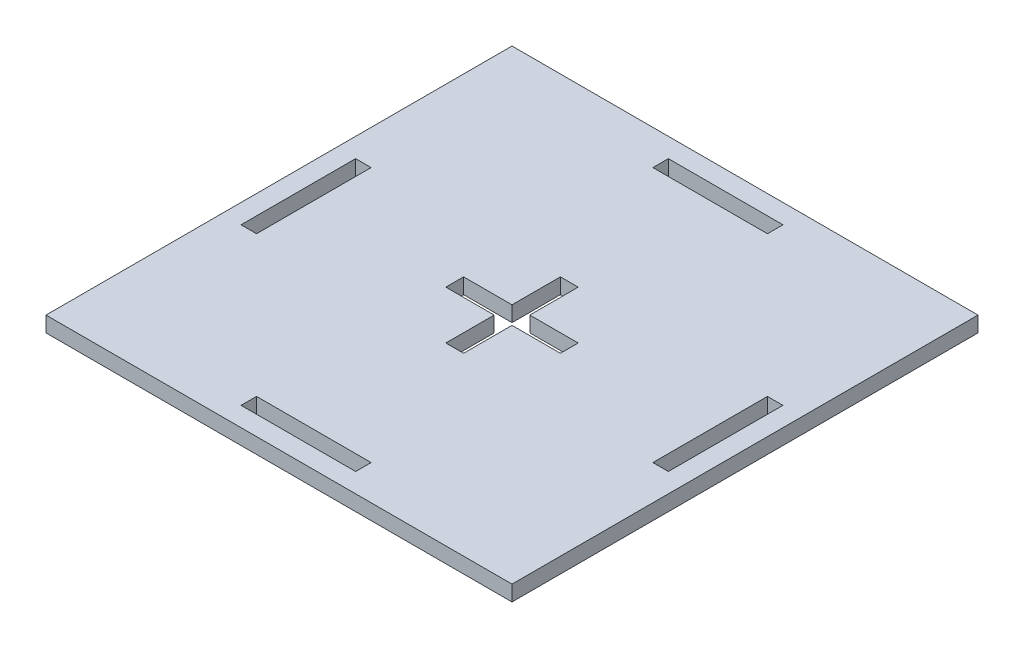
ISO-10303-21;
HEADER;
FILE_DESCRIPTION(('STEP AP214'),'2;1');
FILE_NAME('part.step','',(''),(''),'','','');
FILE_SCHEMA(('AUTOMOTIVE_DESIGN { 1 0 10303 214 1 1 1 1 }'));
ENDSEC;
DATA;
#1=APPLICATION_CONTEXT('core data for automotive mechanical design processes');
#2=APPLICATION_PROTOCOL_DEFINITION('international standard','automotive_design',2000,#1);
#3=PRODUCT_CONTEXT('',#1,'mechanical');
#4=PRODUCT('Part','Part','',(#3));
#5=PRODUCT_RELATED_PRODUCT_CATEGORY('part','',(#4));
#6=PRODUCT_DEFINITION_FORMATION('','',#4);
#7=PRODUCT_DEFINITION_CONTEXT('part definition',#1,'design');
#8=PRODUCT_DEFINITION('design','',#6,#7);
#9=PRODUCT_DEFINITION_SHAPE('','',#8);
#10=(LENGTH_UNIT() NAMED_UNIT(*) SI_UNIT(.MILLI.,.METRE.));
#11=(NAMED_UNIT(*) PLANE_ANGLE_UNIT() SI_UNIT($,.RADIAN.));
#12=(NAMED_UNIT(*) SI_UNIT($,.STERADIAN.) SOLID_ANGLE_UNIT());
#13=UNCERTAINTY_MEASURE_WITH_UNIT(LENGTH_MEASURE(1.E-05),#10,'distance_accuracy_value','');
#14=(GEOMETRIC_REPRESENTATION_CONTEXT(3) GLOBAL_UNCERTAINTY_ASSIGNED_CONTEXT((#13)) GLOBAL_UNIT_ASSIGNED_CONTEXT((#10,
#11,#12)) REPRESENTATION_CONTEXT('',''));
#15=CARTESIAN_POINT('',(0.,0.,0.));
#16=DIRECTION('',(0.,0.,1.));
#17=DIRECTION('',(1.,0.,0.));
#18=AXIS2_PLACEMENT_3D('',#15,#16,#17);
#19=CARTESIAN_POINT('',(0.,-2.,0.));
#20=DIRECTION('',(0.,1.,0.));
#21=DIRECTION('',(0.,0.,1.));
#22=AXIS2_PLACEMENT_3D('',#19,#20,#21);
#23=PLANE('',#22);
#24=DIRECTION('',(1.,0.,0.));
#25=VECTOR('',#24,1.);
#26=CARTESIAN_POINT('',(0.,-2.,28.95));
#27=LINE('',#26,#25);
#28=CARTESIAN_POINT('',(31.25,-2.,28.95));
#29=VERTEX_POINT('',#28);
#30=CARTESIAN_POINT('',(37.5,-2.,28.95));
#31=VERTEX_POINT('',#30);
#32=EDGE_CURVE('E494',#29,#31,#27,.T.);
#33=ORIENTED_EDGE('',*,*,#32,.F.);
#34=DIRECTION('',(0.,0.,1.));
#35=VECTOR('',#34,1.);
#36=CARTESIAN_POINT('',(31.25,-2.,0.));
#37=LINE('',#36,#35);
#38=CARTESIAN_POINT('',(31.25,-2.,22.7));
#39=VERTEX_POINT('',#38);
#40=EDGE_CURVE('E466',#39,#29,#37,.T.);
#41=ORIENTED_EDGE('',*,*,#40,.F.);
#42=DIRECTION('',(1.,0.,0.));
#43=VECTOR('',#42,1.);
#44=CARTESIAN_POINT('',(0.,-2.,22.7));
#45=LINE('',#44,#43);
#46=CARTESIAN_POINT('',(28.95,-2.,22.7));
#47=VERTEX_POINT('',#46);
#48=EDGE_CURVE('E468',#47,#39,#45,.T.);
#49=ORIENTED_EDGE('',*,*,#48,.F.);
#50=DIRECTION('',(0.,0.,1.));
#51=VECTOR('',#50,1.);
#52=CARTESIAN_POINT('',(28.95,-2.,0.));
#53=LINE('',#52,#51);
#54=CARTESIAN_POINT('',(28.95,-2.,28.95));
#55=VERTEX_POINT('',#54);
#56=EDGE_CURVE('E470',#47,#55,#53,.T.);
#57=ORIENTED_EDGE('',*,*,#56,.T.);
#58=DIRECTION('',(1.,0.,0.));
#59=VECTOR('',#58,1.);
#60=CARTESIAN_POINT('',(0.,-2.,28.95));
#61=LINE('',#60,#59);
#62=CARTESIAN_POINT('',(22.7,-2.,28.95));
#63=VERTEX_POINT('',#62);
#64=EDGE_CURVE('E473',#63,#55,#61,.T.);
#65=ORIENTED_EDGE('',*,*,#64,.F.);
#66=DIRECTION('',(0.,0.,1.));
#67=VECTOR('',#66,1.);
#68=CARTESIAN_POINT('',(22.7,-2.,0.));
#69=LINE('',#68,#67);
#70=CARTESIAN_POINT('',(22.7,-2.,31.25));
#71=VERTEX_POINT('',#70);
#72=EDGE_CURVE('E475',#63,#71,#69,.T.);
#73=ORIENTED_EDGE('',*,*,#72,.T.);
#74=DIRECTION('',(1.,0.,0.));
#75=VECTOR('',#74,1.);
#76=CARTESIAN_POINT('',(0.,-2.,31.25));
#77=LINE('',#76,#75);
#78=CARTESIAN_POINT('',(28.95,-2.,31.25));
#79=VERTEX_POINT('',#78);
#80=EDGE_CURVE('E478',#71,#79,#77,.T.);
#81=ORIENTED_EDGE('',*,*,#80,.T.);
#82=DIRECTION('',(0.,0.,1.));
#83=VECTOR('',#82,1.);
#84=CARTESIAN_POINT('',(28.95,-2.,0.));
#85=LINE('',#84,#83);
#86=CARTESIAN_POINT('',(28.95,-2.,37.5));
#87=VERTEX_POINT('',#86);
#88=EDGE_CURVE('E481',#79,#87,#85,.T.);
#89=ORIENTED_EDGE('',*,*,#88,.T.);
#90=DIRECTION('',(1.,0.,0.));
#91=VECTOR('',#90,1.);
#92=CARTESIAN_POINT('',(0.,-2.,37.5));
#93=LINE('',#92,#91);
#94=CARTESIAN_POINT('',(31.25,-2.,37.5));
#95=VERTEX_POINT('',#94);
#96=EDGE_CURVE('E484',#87,#95,#93,.T.);
#97=ORIENTED_EDGE('',*,*,#96,.T.);
#98=DIRECTION('',(0.,0.,1.));
#99=VECTOR('',#98,1.);
#100=CARTESIAN_POINT('',(31.25,-2.,0.));
#101=LINE('',#100,#99);
#102=CARTESIAN_POINT('',(31.25,-2.,31.25));
#103=VERTEX_POINT('',#102);
#104=EDGE_CURVE('E487',#103,#95,#101,.T.);
#105=ORIENTED_EDGE('',*,*,#104,.F.);
#106=DIRECTION('',(1.,0.,0.));
#107=VECTOR('',#106,1.);
#108=CARTESIAN_POINT('',(0.,-2.,31.25));
#109=LINE('',#108,#107);
#110=CARTESIAN_POINT('',(37.5,-2.,31.25));
#111=VERTEX_POINT('',#110);
#112=EDGE_CURVE('E489',#103,#111,#109,.T.);
#113=ORIENTED_EDGE('',*,*,#112,.T.);
#114=DIRECTION('',(0.,0.,1.));
#115=VECTOR('',#114,1.);
#116=CARTESIAN_POINT('',(37.5,-2.,0.));
#117=LINE('',#116,#115);
#118=EDGE_CURVE('E492',#31,#111,#117,.T.);
#119=ORIENTED_EDGE('',*,*,#118,.F.);
#120=EDGE_LOOP('',(#33,#41,#49,#57,#65,#73,#81,#89,#97,#105,#113,#119));
#121=FACE_BOUND('',#120,.T.);
#122=DIRECTION('',(0.,0.,1.));
#123=VECTOR('',#122,1.);
#124=CARTESIAN_POINT('',(0.,-2.,0.));
#125=LINE('',#124,#123);
#126=CARTESIAN_POINT('',(0.,-2.,0.));
#127=VERTEX_POINT('',#126);
#128=CARTESIAN_POINT('',(0.,-2.,60.2));
#129=VERTEX_POINT('',#128);
#130=EDGE_CURVE('E506',#127,#129,#125,.T.);
#131=ORIENTED_EDGE('',*,*,#130,.F.);
#132=DIRECTION('',(1.,0.,0.));
#133=VECTOR('',#132,1.);
#134=CARTESIAN_POINT('',(0.,-2.,0.));
#135=LINE('',#134,#133);
#136=CARTESIAN_POINT('',(60.2,-2.,0.));
#137=VERTEX_POINT('',#136);
#138=EDGE_CURVE('E515',#127,#137,#135,.T.);
#139=ORIENTED_EDGE('',*,*,#138,.T.);
#140=DIRECTION('',(0.,0.,1.));
#141=VECTOR('',#140,1.);
#142=CARTESIAN_POINT('',(60.2,-2.,0.));
#143=LINE('',#142,#141);
#144=CARTESIAN_POINT('',(60.2,-2.,60.2));
#145=VERTEX_POINT('',#144);
#146=EDGE_CURVE('E513',#137,#145,#143,.T.);
#147=ORIENTED_EDGE('',*,*,#146,.T.);
#148=DIRECTION('',(1.,0.,0.));
#149=VECTOR('',#148,1.);
#150=CARTESIAN_POINT('',(0.,-2.,60.2));
#151=LINE('',#150,#149);
#152=EDGE_CURVE('E509',#129,#145,#151,.T.);
#153=ORIENTED_EDGE('',*,*,#152,.F.);
#154=EDGE_LOOP('',(#131,#139,#147,#153));
#155=FACE_BOUND('',#154,.T.);
#156=DIRECTION('',(0.,0.,1.));
#157=VECTOR('',#156,1.);
#158=CARTESIAN_POINT('',(2.5,-2.,0.));
#159=LINE('',#158,#157);
#160=CARTESIAN_POINT('',(2.5,-2.,22.7));
#161=VERTEX_POINT('',#160);
#162=CARTESIAN_POINT('',(2.5,-2.,37.5));
#163=VERTEX_POINT('',#162);
#164=EDGE_CURVE('E441',#161,#163,#159,.T.);
#165=ORIENTED_EDGE('',*,*,#164,.T.);
#166=DIRECTION('',(1.,0.,0.));
#167=VECTOR('',#166,1.);
#168=CARTESIAN_POINT('',(-1.30104260698261E-13,-2.,37.5));
#169=LINE('',#168,#167);
#170=CARTESIAN_POINT('',(4.5,-2.,37.5));
#171=VERTEX_POINT('',#170);
#172=EDGE_CURVE('E444',#163,#171,#169,.T.);
#173=ORIENTED_EDGE('',*,*,#172,.T.);
#174=DIRECTION('',(0.,0.,-1.));
#175=VECTOR('',#174,1.);
#176=CARTESIAN_POINT('',(4.5,-2.,0.));
#177=LINE('',#176,#175);
#178=CARTESIAN_POINT('',(4.5,-2.,22.7));
#179=VERTEX_POINT('',#178);
#180=EDGE_CURVE('E262',#171,#179,#177,.T.);
#181=ORIENTED_EDGE('',*,*,#180,.T.);
#182=DIRECTION('',(1.,0.,0.));
#183=VECTOR('',#182,1.);
#184=CARTESIAN_POINT('',(0.,-2.,22.7));
#185=LINE('',#184,#183);
#186=EDGE_CURVE('E438',#161,#179,#185,.T.);
#187=ORIENTED_EDGE('',*,*,#186,.F.);
#188=EDGE_LOOP('',(#165,#173,#181,#187));
#189=FACE_BOUND('',#188,.T.);
#190=DIRECTION('',(-1.,0.,0.));
#191=VECTOR('',#190,1.);
#192=CARTESIAN_POINT('',(0.,-2.,4.5));
#193=LINE('',#192,#191);
#194=CARTESIAN_POINT('',(37.5,-2.,4.5));
#195=VERTEX_POINT('',#194);
#196=CARTESIAN_POINT('',(22.7,-2.,4.5));
#197=VERTEX_POINT('',#196);
#198=EDGE_CURVE('E452',#195,#197,#193,.T.);
#199=ORIENTED_EDGE('',*,*,#198,.F.);
#200=DIRECTION('',(0.,0.,-1.));
#201=VECTOR('',#200,1.);
#202=CARTESIAN_POINT('',(37.5,-2.,0.));
#203=LINE('',#202,#201);
#204=CARTESIAN_POINT('',(37.5,-2.,2.5));
#205=VERTEX_POINT('',#204);
#206=EDGE_CURVE('E454',#195,#205,#203,.T.);
#207=ORIENTED_EDGE('',*,*,#206,.T.);
#208=DIRECTION('',(1.,0.,0.));
#209=VECTOR('',#208,1.);
#210=CARTESIAN_POINT('',(0.,-2.,2.5));
#211=LINE('',#210,#209);
#212=CARTESIAN_POINT('',(22.7,-2.,2.5));
#213=VERTEX_POINT('',#212);
#214=EDGE_CURVE('E447',#213,#205,#211,.T.);
#215=ORIENTED_EDGE('',*,*,#214,.F.);
#216=DIRECTION('',(0.,0.,-1.));
#217=VECTOR('',#216,1.);
#218=CARTESIAN_POINT('',(22.7,-2.,0.));
#219=LINE('',#218,#217);
#220=EDGE_CURVE('E449',#197,#213,#219,.T.);
#221=ORIENTED_EDGE('',*,*,#220,.F.);
#222=EDGE_LOOP('',(#199,#207,#215,#221));
#223=FACE_BOUND('',#222,.T.);
#224=DIRECTION('',(-1.,0.,0.));
#225=VECTOR('',#224,1.);
#226=CARTESIAN_POINT('',(1.30104260698262E-13,-2.,37.5000000000002));
#227=LINE('',#226,#225);
#228=CARTESIAN_POINT('',(57.7,-2.,37.5));
#229=VERTEX_POINT('',#228);
#230=CARTESIAN_POINT('',(55.7,-2.,37.5));
#231=VERTEX_POINT('',#230);
#232=EDGE_CURVE('E464',#229,#231,#227,.T.);
#233=ORIENTED_EDGE('',*,*,#232,.F.);
#234=DIRECTION('',(0.,0.,1.));
#235=VECTOR('',#234,1.);
#236=CARTESIAN_POINT('',(57.7,-2.,0.));
#237=LINE('',#236,#235);
#238=CARTESIAN_POINT('',(57.7,-2.,22.7));
#239=VERTEX_POINT('',#238);
#240=EDGE_CURVE('E457',#239,#229,#237,.T.);
#241=ORIENTED_EDGE('',*,*,#240,.F.);
#242=DIRECTION('',(-1.,0.,0.));
#243=VECTOR('',#242,1.);
#244=CARTESIAN_POINT('',(0.,-2.,22.6999999999998));
#245=LINE('',#244,#243);
#246=CARTESIAN_POINT('',(55.7,-2.,22.7));
#247=VERTEX_POINT('',#246);
#248=EDGE_CURVE('E459',#239,#247,#245,.T.);
#249=ORIENTED_EDGE('',*,*,#248,.T.);
#250=DIRECTION('',(0.,0.,-1.));
#251=VECTOR('',#250,1.);
#252=CARTESIAN_POINT('',(55.7,-2.,0.));
#253=LINE('',#252,#251);
#254=EDGE_CURVE('E462',#231,#247,#253,.T.);
#255=ORIENTED_EDGE('',*,*,#254,.F.);
#256=EDGE_LOOP('',(#233,#241,#249,#255));
#257=FACE_BOUND('',#256,.T.);
#258=DIRECTION('',(0.,0.,1.));
#259=VECTOR('',#258,1.);
#260=CARTESIAN_POINT('',(37.5,-2.,0.));
#261=LINE('',#260,#259);
#262=CARTESIAN_POINT('',(37.5,-2.,55.7));
#263=VERTEX_POINT('',#262);
#264=CARTESIAN_POINT('',(37.5,-2.,57.7));
#265=VERTEX_POINT('',#264);
#266=EDGE_CURVE('E259',#263,#265,#261,.T.);
#267=ORIENTED_EDGE('',*,*,#266,.F.);
#268=DIRECTION('',(-1.,0.,0.));
#269=VECTOR('',#268,1.);
#270=CARTESIAN_POINT('',(0.,-2.,55.7));
#271=LINE('',#270,#269);
#272=CARTESIAN_POINT('',(22.7,-2.,55.7));
#273=VERTEX_POINT('',#272);
#274=EDGE_CURVE('E496',#263,#273,#271,.T.);
#275=ORIENTED_EDGE('',*,*,#274,.T.);
#276=DIRECTION('',(0.,0.,1.));
#277=VECTOR('',#276,1.);
#278=CARTESIAN_POINT('',(22.6999999999999,-2.,0.));
#279=LINE('',#278,#277);
#280=CARTESIAN_POINT('',(22.7,-2.,57.7));
#281=VERTEX_POINT('',#280);
#282=EDGE_CURVE('E499',#273,#281,#279,.T.);
#283=ORIENTED_EDGE('',*,*,#282,.T.);
#284=DIRECTION('',(1.,0.,0.));
#285=VECTOR('',#284,1.);
#286=CARTESIAN_POINT('',(0.,-2.,57.7));
#287=LINE('',#286,#285);
#288=EDGE_CURVE('E502',#281,#265,#287,.T.);
#289=ORIENTED_EDGE('',*,*,#288,.T.);
#290=EDGE_LOOP('',(#267,#275,#283,#289));
#291=FACE_BOUND('',#290,.T.);
#292=ADVANCED_FACE('F42',(#121,#155,#189,#223,#257,#291),#23,.F.);
#293=CARTESIAN_POINT('',(0.,0.,0.));
#294=DIRECTION('',(0.,1.,0.));
#295=DIRECTION('',(0.,0.,1.));
#296=AXIS2_PLACEMENT_3D('',#293,#294,#295);
#297=PLANE('',#296);
#298=DIRECTION('',(0.,0.,-1.));
#299=VECTOR('',#298,1.);
#300=CARTESIAN_POINT('',(37.5,0.,4.5));
#301=LINE('',#300,#299);
#302=CARTESIAN_POINT('',(37.5,0.,4.5));
#303=VERTEX_POINT('',#302);
#304=CARTESIAN_POINT('',(37.5,0.,2.5));
#305=VERTEX_POINT('',#304);
#306=EDGE_CURVE('E388',#303,#305,#301,.T.);
#307=ORIENTED_EDGE('',*,*,#306,.F.);
#308=DIRECTION('',(-1.,0.,0.));
#309=VECTOR('',#308,1.);
#310=CARTESIAN_POINT('',(37.5,0.,4.5));
#311=LINE('',#310,#309);
#312=CARTESIAN_POINT('',(22.7,0.,4.5));
#313=VERTEX_POINT('',#312);
#314=EDGE_CURVE('E412',#303,#313,#311,.T.);
#315=ORIENTED_EDGE('',*,*,#314,.T.);
#316=DIRECTION('',(0.,0.,-1.));
#317=VECTOR('',#316,1.);
#318=CARTESIAN_POINT('',(22.7,0.,4.5));
#319=LINE('',#318,#317);
#320=CARTESIAN_POINT('',(22.7,0.,2.5));
#321=VERTEX_POINT('',#320);
#322=EDGE_CURVE('E422',#313,#321,#319,.T.);
#323=ORIENTED_EDGE('',*,*,#322,.T.);
#324=DIRECTION('',(1.,0.,0.));
#325=VECTOR('',#324,1.);
#326=CARTESIAN_POINT('',(22.7,0.,2.5));
#327=LINE('',#326,#325);
#328=EDGE_CURVE('E429',#321,#305,#327,.T.);
#329=ORIENTED_EDGE('',*,*,#328,.T.);
#330=EDGE_LOOP('',(#307,#315,#323,#329));
#331=FACE_BOUND('',#330,.T.);
#332=DIRECTION('',(1.,0.,0.));
#333=VECTOR('',#332,1.);
#334=CARTESIAN_POINT('',(2.5,0.,37.5));
#335=LINE('',#334,#333);
#336=CARTESIAN_POINT('',(2.5,0.,37.5));
#337=VERTEX_POINT('',#336);
#338=CARTESIAN_POINT('',(4.5,0.,37.5));
#339=VERTEX_POINT('',#338);
#340=EDGE_CURVE('E279',#337,#339,#335,.T.);
#341=ORIENTED_EDGE('',*,*,#340,.F.);
#342=DIRECTION('',(0.,0.,1.));
#343=VECTOR('',#342,1.);
#344=CARTESIAN_POINT('',(2.5,0.,22.7));
#345=LINE('',#344,#343);
#346=CARTESIAN_POINT('',(2.5,0.,22.7));
#347=VERTEX_POINT('',#346);
#348=EDGE_CURVE('E381',#347,#337,#345,.T.);
#349=ORIENTED_EDGE('',*,*,#348,.F.);
#350=DIRECTION('',(1.,0.,0.));
#351=VECTOR('',#350,1.);
#352=CARTESIAN_POINT('',(2.5,0.,22.7));
#353=LINE('',#352,#351);
#354=CARTESIAN_POINT('',(4.5,0.,22.7));
#355=VERTEX_POINT('',#354);
#356=EDGE_CURVE('E393',#347,#355,#353,.T.);
#357=ORIENTED_EDGE('',*,*,#356,.T.);
#358=DIRECTION('',(0.,0.,-1.));
#359=VECTOR('',#358,1.);
#360=CARTESIAN_POINT('',(4.5,0.,37.5));
#361=LINE('',#360,#359);
#362=EDGE_CURVE('E283',#339,#355,#361,.T.);
#363=ORIENTED_EDGE('',*,*,#362,.F.);
#364=EDGE_LOOP('',(#341,#349,#357,#363));
#365=FACE_BOUND('',#364,.T.);
#366=DIRECTION('',(0.,0.,1.));
#367=VECTOR('',#366,1.);
#368=CARTESIAN_POINT('',(0.,0.,0.));
#369=LINE('',#368,#367);
#370=CARTESIAN_POINT('',(0.,0.,0.));
#371=VERTEX_POINT('',#370);
#372=CARTESIAN_POINT('',(0.,0.,60.2));
#373=VERTEX_POINT('',#372);
#374=EDGE_CURVE('E505',#371,#373,#369,.T.);
#375=ORIENTED_EDGE('',*,*,#374,.T.);
#376=DIRECTION('',(1.,0.,0.));
#377=VECTOR('',#376,1.);
#378=CARTESIAN_POINT('',(0.,0.,60.2));
#379=LINE('',#378,#377);
#380=CARTESIAN_POINT('',(60.2,0.,60.2));
#381=VERTEX_POINT('',#380);
#382=EDGE_CURVE('E520',#373,#381,#379,.T.);
#383=ORIENTED_EDGE('',*,*,#382,.T.);
#384=DIRECTION('',(0.,0.,1.));
#385=VECTOR('',#384,1.);
#386=CARTESIAN_POINT('',(60.2,0.,0.));
#387=LINE('',#386,#385);
#388=CARTESIAN_POINT('',(60.2,0.,0.));
#389=VERTEX_POINT('',#388);
#390=EDGE_CURVE('E525',#389,#381,#387,.T.);
#391=ORIENTED_EDGE('',*,*,#390,.F.);
#392=DIRECTION('',(1.,0.,0.));
#393=VECTOR('',#392,1.);
#394=CARTESIAN_POINT('',(0.,0.,0.));
#395=LINE('',#394,#393);
#396=EDGE_CURVE('E510',#371,#389,#395,.T.);
#397=ORIENTED_EDGE('',*,*,#396,.F.);
#398=EDGE_LOOP('',(#375,#383,#391,#397));
#399=FACE_BOUND('',#398,.T.);
#400=DIRECTION('',(0.,0.,1.));
#401=VECTOR('',#400,1.);
#402=CARTESIAN_POINT('',(57.7,0.,22.7));
#403=LINE('',#402,#401);
#404=CARTESIAN_POINT('',(57.7,0.,22.7));
#405=VERTEX_POINT('',#404);
#406=CARTESIAN_POINT('',(57.7,0.,37.5));
#407=VERTEX_POINT('',#406);
#408=EDGE_CURVE('E310',#405,#407,#403,.T.);
#409=ORIENTED_EDGE('',*,*,#408,.T.);
#410=DIRECTION('',(-1.,0.,0.));
#411=VECTOR('',#410,1.);
#412=CARTESIAN_POINT('',(57.7,0.,37.5));
#413=LINE('',#412,#411);
#414=CARTESIAN_POINT('',(55.7,0.,37.5));
#415=VERTEX_POINT('',#414);
#416=EDGE_CURVE('E326',#407,#415,#413,.T.);
#417=ORIENTED_EDGE('',*,*,#416,.T.);
#418=DIRECTION('',(0.,0.,-1.));
#419=VECTOR('',#418,1.);
#420=CARTESIAN_POINT('',(55.7,0.,37.5));
#421=LINE('',#420,#419);
#422=CARTESIAN_POINT('',(55.7,0.,22.7));
#423=VERTEX_POINT('',#422);
#424=EDGE_CURVE('E332',#415,#423,#421,.T.);
#425=ORIENTED_EDGE('',*,*,#424,.T.);
#426=DIRECTION('',(-1.,0.,0.));
#427=VECTOR('',#426,1.);
#428=CARTESIAN_POINT('',(57.7,0.,22.7));
#429=LINE('',#428,#427);
#430=EDGE_CURVE('E315',#405,#423,#429,.T.);
#431=ORIENTED_EDGE('',*,*,#430,.F.);
#432=EDGE_LOOP('',(#409,#417,#425,#431));
#433=FACE_BOUND('',#432,.T.);
#434=DIRECTION('',(0.,0.,1.));
#435=VECTOR('',#434,1.);
#436=CARTESIAN_POINT('',(31.25,0.,22.7));
#437=LINE('',#436,#435);
#438=CARTESIAN_POINT('',(31.25,0.,22.7));
#439=VERTEX_POINT('',#438);
#440=CARTESIAN_POINT('',(31.25,0.,28.95));
#441=VERTEX_POINT('',#440);
#442=EDGE_CURVE('E358',#439,#441,#437,.T.);
#443=ORIENTED_EDGE('',*,*,#442,.T.);
#444=DIRECTION('',(1.,0.,0.));
#445=VECTOR('',#444,1.);
#446=CARTESIAN_POINT('',(31.25,0.,28.95));
#447=LINE('',#446,#445);
#448=CARTESIAN_POINT('',(37.5,0.,28.95));
#449=VERTEX_POINT('',#448);
#450=EDGE_CURVE('E303',#441,#449,#447,.T.);
#451=ORIENTED_EDGE('',*,*,#450,.T.);
#452=DIRECTION('',(0.,0.,1.));
#453=VECTOR('',#452,1.);
#454=CARTESIAN_POINT('',(37.5,0.,28.95));
#455=LINE('',#454,#453);
#456=CARTESIAN_POINT('',(37.5,0.,31.25));
#457=VERTEX_POINT('',#456);
#458=EDGE_CURVE('E375',#449,#457,#455,.T.);
#459=ORIENTED_EDGE('',*,*,#458,.T.);
#460=DIRECTION('',(1.,0.,0.));
#461=VECTOR('',#460,1.);
#462=CARTESIAN_POINT('',(31.25,0.,31.25));
#463=LINE('',#462,#461);
#464=CARTESIAN_POINT('',(31.25,0.,31.25));
#465=VERTEX_POINT('',#464);
#466=EDGE_CURVE('E905',#465,#457,#463,.T.);
#467=ORIENTED_EDGE('',*,*,#466,.F.);
#468=DIRECTION('',(0.,0.,1.));
#469=VECTOR('',#468,1.);
#470=CARTESIAN_POINT('',(31.25,0.,31.25));
#471=LINE('',#470,#469);
#472=CARTESIAN_POINT('',(31.25,0.,37.5));
#473=VERTEX_POINT('',#472);
#474=EDGE_CURVE('E908',#465,#473,#471,.T.);
#475=ORIENTED_EDGE('',*,*,#474,.T.);
#476=DIRECTION('',(1.,0.,0.));
#477=VECTOR('',#476,1.);
#478=CARTESIAN_POINT('',(28.95,0.,37.5));
#479=LINE('',#478,#477);
#480=CARTESIAN_POINT('',(28.95,0.,37.5));
#481=VERTEX_POINT('',#480);
#482=EDGE_CURVE('E911',#481,#473,#479,.T.);
#483=ORIENTED_EDGE('',*,*,#482,.F.);
#484=DIRECTION('',(0.,0.,1.));
#485=VECTOR('',#484,1.);
#486=CARTESIAN_POINT('',(28.95,0.,31.25));
#487=LINE('',#486,#485);
#488=CARTESIAN_POINT('',(28.95,0.,31.25));
#489=VERTEX_POINT('',#488);
#490=EDGE_CURVE('E915',#489,#481,#487,.T.);
#491=ORIENTED_EDGE('',*,*,#490,.F.);
#492=DIRECTION('',(1.,0.,0.));
#493=VECTOR('',#492,1.);
#494=CARTESIAN_POINT('',(22.7,0.,31.25));
#495=LINE('',#494,#493);
#496=CARTESIAN_POINT('',(22.7,0.,31.25));
#497=VERTEX_POINT('',#496);
#498=EDGE_CURVE('E919',#497,#489,#495,.T.);
#499=ORIENTED_EDGE('',*,*,#498,.F.);
#500=DIRECTION('',(0.,0.,1.));
#501=VECTOR('',#500,1.);
#502=CARTESIAN_POINT('',(22.7,0.,28.95));
#503=LINE('',#502,#501);
#504=CARTESIAN_POINT('',(22.7,0.,28.95));
#505=VERTEX_POINT('',#504);
#506=EDGE_CURVE('E923',#505,#497,#503,.T.);
#507=ORIENTED_EDGE('',*,*,#506,.F.);
#508=DIRECTION('',(1.,0.,0.));
#509=VECTOR('',#508,1.);
#510=CARTESIAN_POINT('',(22.7,0.,28.95));
#511=LINE('',#510,#509);
#512=CARTESIAN_POINT('',(28.95,0.,28.95));
#513=VERTEX_POINT('',#512);
#514=EDGE_CURVE('E927',#505,#513,#511,.T.);
#515=ORIENTED_EDGE('',*,*,#514,.T.);
#516=DIRECTION('',(0.,0.,1.));
#517=VECTOR('',#516,1.);
#518=CARTESIAN_POINT('',(28.95,0.,22.7));
#519=LINE('',#518,#517);
#520=CARTESIAN_POINT('',(28.95,0.,22.7));
#521=VERTEX_POINT('',#520);
#522=EDGE_CURVE('E931',#521,#513,#519,.T.);
#523=ORIENTED_EDGE('',*,*,#522,.F.);
#524=DIRECTION('',(1.,0.,0.));
#525=VECTOR('',#524,1.);
#526=CARTESIAN_POINT('',(28.95,0.,22.7));
#527=LINE('',#526,#525);
#528=EDGE_CURVE('E362',#521,#439,#527,.T.);
#529=ORIENTED_EDGE('',*,*,#528,.T.);
#530=EDGE_LOOP('',(#443,#451,#459,#467,#475,#483,#491,#499,#507,#515,#523,#529));
#531=FACE_BOUND('',#530,.T.);
#532=DIRECTION('',(-1.,0.,0.));
#533=VECTOR('',#532,1.);
#534=CARTESIAN_POINT('',(37.5,0.,55.7));
#535=LINE('',#534,#533);
#536=CARTESIAN_POINT('',(37.5,0.,55.7));
#537=VERTEX_POINT('',#536);
#538=CARTESIAN_POINT('',(22.7,0.,55.7));
#539=VERTEX_POINT('',#538);
#540=EDGE_CURVE('E277',#537,#539,#535,.T.);
#541=ORIENTED_EDGE('',*,*,#540,.F.);
#542=DIRECTION('',(0.,0.,1.));
#543=VECTOR('',#542,1.);
#544=CARTESIAN_POINT('',(37.5,0.,55.7));
#545=LINE('',#544,#543);
#546=CARTESIAN_POINT('',(37.5,0.,57.7));
#547=VERTEX_POINT('',#546);
#548=EDGE_CURVE('E256',#537,#547,#545,.T.);
#549=ORIENTED_EDGE('',*,*,#548,.T.);
#550=DIRECTION('',(1.,0.,0.));
#551=VECTOR('',#550,1.);
#552=CARTESIAN_POINT('',(22.7,0.,57.7));
#553=LINE('',#552,#551);
#554=CARTESIAN_POINT('',(22.7,0.,57.7));
#555=VERTEX_POINT('',#554);
#556=EDGE_CURVE('E266',#555,#547,#553,.T.);
#557=ORIENTED_EDGE('',*,*,#556,.F.);
#558=DIRECTION('',(0.,0.,1.));
#559=VECTOR('',#558,1.);
#560=CARTESIAN_POINT('',(22.7,0.,55.7));
#561=LINE('',#560,#559);
#562=EDGE_CURVE('E273',#539,#555,#561,.T.);
#563=ORIENTED_EDGE('',*,*,#562,.F.);
#564=EDGE_LOOP('',(#541,#549,#557,#563));
#565=FACE_BOUND('',#564,.T.);
#566=ADVANCED_FACE('F276',(#331,#365,#399,#433,#531,#565),#297,.T.);
#567=CARTESIAN_POINT('',(0.,-2.,0.));
#568=DIRECTION('',(-1.,0.,0.));
#569=DIRECTION('',(0.,0.,1.));
#570=AXIS2_PLACEMENT_3D('',#567,#568,#569);
#571=PLANE('',#570);
#572=ORIENTED_EDGE('',*,*,#374,.F.);
#573=DIRECTION('',(0.,1.,0.));
#574=VECTOR('',#573,1.);
#575=CARTESIAN_POINT('',(0.,-2.,0.));
#576=LINE('',#575,#574);
#577=EDGE_CURVE('E12',#127,#371,#576,.T.);
#578=ORIENTED_EDGE('',*,*,#577,.F.);
#579=ORIENTED_EDGE('',*,*,#130,.T.);
#580=DIRECTION('',(0.,1.,0.));
#581=VECTOR('',#580,1.);
#582=CARTESIAN_POINT('',(0.,-2.,60.2));
#583=LINE('',#582,#581);
#584=EDGE_CURVE('E46',#129,#373,#583,.T.);
#585=ORIENTED_EDGE('',*,*,#584,.T.);
#586=EDGE_LOOP('',(#572,#578,#579,#585));
#587=FACE_BOUND('',#586,.T.);
#588=ADVANCED_FACE('F44',(#587),#571,.T.);
#589=CARTESIAN_POINT('',(0.,-2.,0.));
#590=DIRECTION('',(0.,0.,1.));
#591=DIRECTION('',(1.,0.,0.));
#592=AXIS2_PLACEMENT_3D('',#589,#590,#591);
#593=PLANE('',#592);
#594=ORIENTED_EDGE('',*,*,#396,.T.);
#595=DIRECTION('',(0.,1.,0.));
#596=VECTOR('',#595,1.);
#597=CARTESIAN_POINT('',(60.2,-2.,0.));
#598=LINE('',#597,#596);
#599=EDGE_CURVE('E51',#137,#389,#598,.T.);
#600=ORIENTED_EDGE('',*,*,#599,.F.);
#601=ORIENTED_EDGE('',*,*,#138,.F.);
#602=ORIENTED_EDGE('',*,*,#577,.T.);
#603=EDGE_LOOP('',(#594,#600,#601,#602));
#604=FACE_BOUND('',#603,.T.);
#605=ADVANCED_FACE('F548',(#604),#593,.F.);
#606=CARTESIAN_POINT('',(60.2,-2.,0.));
#607=DIRECTION('',(-1.,0.,0.));
#608=DIRECTION('',(0.,0.,1.));
#609=AXIS2_PLACEMENT_3D('',#606,#607,#608);
#610=PLANE('',#609);
#611=ORIENTED_EDGE('',*,*,#390,.T.);
#612=DIRECTION('',(0.,1.,0.));
#613=VECTOR('',#612,1.);
#614=CARTESIAN_POINT('',(60.2,-2.,60.2));
#615=LINE('',#614,#613);
#616=EDGE_CURVE('E533',#145,#381,#615,.T.);
#617=ORIENTED_EDGE('',*,*,#616,.F.);
#618=ORIENTED_EDGE('',*,*,#146,.F.);
#619=ORIENTED_EDGE('',*,*,#599,.T.);
#620=EDGE_LOOP('',(#611,#617,#618,#619));
#621=FACE_BOUND('',#620,.T.);
#622=ADVANCED_FACE('F552',(#621),#610,.F.);
#623=CARTESIAN_POINT('',(0.,-2.,60.2));
#624=DIRECTION('',(0.,0.,1.));
#625=DIRECTION('',(1.,0.,0.));
#626=AXIS2_PLACEMENT_3D('',#623,#624,#625);
#627=PLANE('',#626);
#628=ORIENTED_EDGE('',*,*,#382,.F.);
#629=ORIENTED_EDGE('',*,*,#584,.F.);
#630=ORIENTED_EDGE('',*,*,#152,.T.);
#631=ORIENTED_EDGE('',*,*,#616,.T.);
#632=EDGE_LOOP('',(#628,#629,#630,#631));
#633=FACE_BOUND('',#632,.T.);
#634=ADVANCED_FACE('F541',(#633),#627,.T.);
#635=CARTESIAN_POINT('',(2.5,-10.,37.5));
#636=DIRECTION('',(0.,0.,1.));
#637=DIRECTION('',(1.,0.,0.));
#638=AXIS2_PLACEMENT_3D('',#635,#636,#637);
#639=PLANE('',#638);
#640=DIRECTION('',(0.,1.,0.));
#641=VECTOR('',#640,1.);
#642=CARTESIAN_POINT('',(2.5,-10.,37.5));
#643=LINE('',#642,#641);
#644=EDGE_CURVE('E386',#163,#337,#643,.T.);
#645=ORIENTED_EDGE('',*,*,#644,.T.);
#646=ORIENTED_EDGE('',*,*,#340,.T.);
#647=DIRECTION('',(0.,1.,0.));
#648=VECTOR('',#647,1.);
#649=CARTESIAN_POINT('',(4.5,-10.,37.5));
#650=LINE('',#649,#648);
#651=EDGE_CURVE('E378',#171,#339,#650,.T.);
#652=ORIENTED_EDGE('',*,*,#651,.F.);
#653=ORIENTED_EDGE('',*,*,#172,.F.);
#654=EDGE_LOOP('',(#645,#646,#652,#653));
#655=FACE_BOUND('',#654,.T.);
#656=ADVANCED_FACE('F646',(#655),#639,.F.);
#657=CARTESIAN_POINT('',(2.5,-10.,22.7));
#658=DIRECTION('',(-1.,0.,0.));
#659=DIRECTION('',(0.,0.,1.));
#660=AXIS2_PLACEMENT_3D('',#657,#658,#659);
#661=PLANE('',#660);
#662=DIRECTION('',(0.,1.,0.));
#663=VECTOR('',#662,1.);
#664=CARTESIAN_POINT('',(2.5,-10.,22.7));
#665=LINE('',#664,#663);
#666=EDGE_CURVE('E384',#161,#347,#665,.T.);
#667=ORIENTED_EDGE('',*,*,#666,.T.);
#668=ORIENTED_EDGE('',*,*,#348,.T.);
#669=ORIENTED_EDGE('',*,*,#644,.F.);
#670=ORIENTED_EDGE('',*,*,#164,.F.);
#671=EDGE_LOOP('',(#667,#668,#669,#670));
#672=FACE_BOUND('',#671,.T.);
#673=ADVANCED_FACE('F649',(#672),#661,.F.);
#674=CARTESIAN_POINT('',(2.5,-10.,22.7));
#675=DIRECTION('',(0.,0.,1.));
#676=DIRECTION('',(1.,0.,0.));
#677=AXIS2_PLACEMENT_3D('',#674,#675,#676);
#678=PLANE('',#677);
#679=ORIENTED_EDGE('',*,*,#186,.T.);
#680=DIRECTION('',(0.,1.,0.));
#681=VECTOR('',#680,1.);
#682=CARTESIAN_POINT('',(4.5,-10.,22.7));
#683=LINE('',#682,#681);
#684=EDGE_CURVE('E382',#179,#355,#683,.T.);
#685=ORIENTED_EDGE('',*,*,#684,.T.);
#686=ORIENTED_EDGE('',*,*,#356,.F.);
#687=ORIENTED_EDGE('',*,*,#666,.F.);
#688=EDGE_LOOP('',(#679,#685,#686,#687));
#689=FACE_BOUND('',#688,.T.);
#690=ADVANCED_FACE('F655',(#689),#678,.T.);
#691=CARTESIAN_POINT('',(4.5,-10.,37.5));
#692=DIRECTION('',(1.,0.,0.));
#693=DIRECTION('',(0.,0.,-1.));
#694=AXIS2_PLACEMENT_3D('',#691,#692,#693);
#695=PLANE('',#694);
#696=ORIENTED_EDGE('',*,*,#651,.T.);
#697=ORIENTED_EDGE('',*,*,#362,.T.);
#698=ORIENTED_EDGE('',*,*,#684,.F.);
#699=ORIENTED_EDGE('',*,*,#180,.F.);
#700=EDGE_LOOP('',(#696,#697,#698,#699));
#701=FACE_BOUND('',#700,.T.);
#702=ADVANCED_FACE('F651',(#701),#695,.F.);
#703=CARTESIAN_POINT('',(37.5,-10.,4.5));
#704=DIRECTION('',(1.,0.,0.));
#705=DIRECTION('',(0.,0.,-1.));
#706=AXIS2_PLACEMENT_3D('',#703,#704,#705);
#707=PLANE('',#706);
#708=DIRECTION('',(0.,1.,0.));
#709=VECTOR('',#708,1.);
#710=CARTESIAN_POINT('',(37.5,-10.,4.5));
#711=LINE('',#710,#709);
#712=EDGE_CURVE('E331',#195,#303,#711,.T.);
#713=ORIENTED_EDGE('',*,*,#712,.T.);
#714=ORIENTED_EDGE('',*,*,#306,.T.);
#715=DIRECTION('',(0.,1.,0.));
#716=VECTOR('',#715,1.);
#717=CARTESIAN_POINT('',(37.5,-10.,2.5));
#718=LINE('',#717,#716);
#719=EDGE_CURVE('E409',#205,#305,#718,.T.);
#720=ORIENTED_EDGE('',*,*,#719,.F.);
#721=ORIENTED_EDGE('',*,*,#206,.F.);
#722=EDGE_LOOP('',(#713,#714,#720,#721));
#723=FACE_BOUND('',#722,.T.);
#724=ADVANCED_FACE('F654',(#723),#707,.F.);
#725=CARTESIAN_POINT('',(37.5,-10.,4.5));
#726=DIRECTION('',(0.,0.,-1.));
#727=DIRECTION('',(-1.,0.,0.));
#728=AXIS2_PLACEMENT_3D('',#725,#726,#727);
#729=PLANE('',#728);
#730=ORIENTED_EDGE('',*,*,#198,.T.);
#731=DIRECTION('',(0.,1.,0.));
#732=VECTOR('',#731,1.);
#733=CARTESIAN_POINT('',(22.7,-10.,4.5));
#734=LINE('',#733,#732);
#735=EDGE_CURVE('E415',#197,#313,#734,.T.);
#736=ORIENTED_EDGE('',*,*,#735,.T.);
#737=ORIENTED_EDGE('',*,*,#314,.F.);
#738=ORIENTED_EDGE('',*,*,#712,.F.);
#739=EDGE_LOOP('',(#730,#736,#737,#738));
#740=FACE_BOUND('',#739,.T.);
#741=ADVANCED_FACE('F665',(#740),#729,.T.);
#742=CARTESIAN_POINT('',(22.7,-10.,4.5));
#743=DIRECTION('',(1.,0.,0.));
#744=DIRECTION('',(0.,0.,-1.));
#745=AXIS2_PLACEMENT_3D('',#742,#743,#744);
#746=PLANE('',#745);
#747=ORIENTED_EDGE('',*,*,#220,.T.);
#748=DIRECTION('',(0.,1.,0.));
#749=VECTOR('',#748,1.);
#750=CARTESIAN_POINT('',(22.7,-10.,2.5));
#751=LINE('',#750,#749);
#752=EDGE_CURVE('E413',#213,#321,#751,.T.);
#753=ORIENTED_EDGE('',*,*,#752,.T.);
#754=ORIENTED_EDGE('',*,*,#322,.F.);
#755=ORIENTED_EDGE('',*,*,#735,.F.);
#756=EDGE_LOOP('',(#747,#753,#754,#755));
#757=FACE_BOUND('',#756,.T.);
#758=ADVANCED_FACE('F669',(#757),#746,.T.);
#759=CARTESIAN_POINT('',(22.7,-10.,2.5));
#760=DIRECTION('',(0.,0.,1.));
#761=DIRECTION('',(1.,0.,0.));
#762=AXIS2_PLACEMENT_3D('',#759,#760,#761);
#763=PLANE('',#762);
#764=ORIENTED_EDGE('',*,*,#214,.T.);
#765=ORIENTED_EDGE('',*,*,#719,.T.);
#766=ORIENTED_EDGE('',*,*,#328,.F.);
#767=ORIENTED_EDGE('',*,*,#752,.F.);
#768=EDGE_LOOP('',(#764,#765,#766,#767));
#769=FACE_BOUND('',#768,.T.);
#770=ADVANCED_FACE('F587',(#769),#763,.T.);
#771=CARTESIAN_POINT('',(57.7,-10.,37.5));
#772=DIRECTION('',(0.,0.,-1.));
#773=DIRECTION('',(-1.,0.,0.));
#774=AXIS2_PLACEMENT_3D('',#771,#772,#773);
#775=PLANE('',#774);
#776=ORIENTED_EDGE('',*,*,#232,.T.);
#777=DIRECTION('',(0.,1.,0.));
#778=VECTOR('',#777,1.);
#779=CARTESIAN_POINT('',(55.7,-10.,37.5));
#780=LINE('',#779,#778);
#781=EDGE_CURVE('E300',#231,#415,#780,.T.);
#782=ORIENTED_EDGE('',*,*,#781,.T.);
#783=ORIENTED_EDGE('',*,*,#416,.F.);
#784=DIRECTION('',(0.,1.,0.));
#785=VECTOR('',#784,1.);
#786=CARTESIAN_POINT('',(57.7,-10.,37.5));
#787=LINE('',#786,#785);
#788=EDGE_CURVE('E307',#229,#407,#787,.T.);
#789=ORIENTED_EDGE('',*,*,#788,.F.);
#790=EDGE_LOOP('',(#776,#782,#783,#789));
#791=FACE_BOUND('',#790,.T.);
#792=ADVANCED_FACE('F583',(#791),#775,.T.);
#793=CARTESIAN_POINT('',(55.7,-10.,37.5));
#794=DIRECTION('',(1.,0.,0.));
#795=DIRECTION('',(0.,0.,-1.));
#796=AXIS2_PLACEMENT_3D('',#793,#794,#795);
#797=PLANE('',#796);
#798=ORIENTED_EDGE('',*,*,#254,.T.);
#799=DIRECTION('',(0.,1.,0.));
#800=VECTOR('',#799,1.);
#801=CARTESIAN_POINT('',(55.7,-10.,22.7));
#802=LINE('',#801,#800);
#803=EDGE_CURVE('E302',#247,#423,#802,.T.);
#804=ORIENTED_EDGE('',*,*,#803,.T.);
#805=ORIENTED_EDGE('',*,*,#424,.F.);
#806=ORIENTED_EDGE('',*,*,#781,.F.);
#807=EDGE_LOOP('',(#798,#804,#805,#806));
#808=FACE_BOUND('',#807,.T.);
#809=ADVANCED_FACE('F586',(#808),#797,.T.);
#810=CARTESIAN_POINT('',(57.7,-10.,22.7));
#811=DIRECTION('',(0.,0.,-1.));
#812=DIRECTION('',(-1.,0.,0.));
#813=AXIS2_PLACEMENT_3D('',#810,#811,#812);
#814=PLANE('',#813);
#815=DIRECTION('',(0.,1.,0.));
#816=VECTOR('',#815,1.);
#817=CARTESIAN_POINT('',(57.7,-10.,22.7));
#818=LINE('',#817,#816);
#819=EDGE_CURVE('E305',#239,#405,#818,.T.);
#820=ORIENTED_EDGE('',*,*,#819,.T.);
#821=ORIENTED_EDGE('',*,*,#430,.T.);
#822=ORIENTED_EDGE('',*,*,#803,.F.);
#823=ORIENTED_EDGE('',*,*,#248,.F.);
#824=EDGE_LOOP('',(#820,#821,#822,#823));
#825=FACE_BOUND('',#824,.T.);
#826=ADVANCED_FACE('F591',(#825),#814,.F.);
#827=CARTESIAN_POINT('',(57.7,-10.,22.7));
#828=DIRECTION('',(-1.,0.,0.));
#829=DIRECTION('',(0.,0.,1.));
#830=AXIS2_PLACEMENT_3D('',#827,#828,#829);
#831=PLANE('',#830);
#832=ORIENTED_EDGE('',*,*,#240,.T.);
#833=ORIENTED_EDGE('',*,*,#788,.T.);
#834=ORIENTED_EDGE('',*,*,#408,.F.);
#835=ORIENTED_EDGE('',*,*,#819,.F.);
#836=EDGE_LOOP('',(#832,#833,#834,#835));
#837=FACE_BOUND('',#836,.T.);
#838=ADVANCED_FACE('F595',(#837),#831,.T.);
#839=CARTESIAN_POINT('',(31.25,-10.,28.95));
#840=DIRECTION('',(0.,0.,1.));
#841=DIRECTION('',(1.,0.,0.));
#842=AXIS2_PLACEMENT_3D('',#839,#840,#841);
#843=PLANE('',#842);
#844=ORIENTED_EDGE('',*,*,#32,.T.);
#845=DIRECTION('',(0.,1.,0.));
#846=VECTOR('',#845,1.);
#847=CARTESIAN_POINT('',(37.5,-10.,28.95));
#848=LINE('',#847,#846);
#849=EDGE_CURVE('E334',#31,#449,#848,.T.);
#850=ORIENTED_EDGE('',*,*,#849,.T.);
#851=ORIENTED_EDGE('',*,*,#450,.F.);
#852=DIRECTION('',(0.,1.,0.));
#853=VECTOR('',#852,1.);
#854=CARTESIAN_POINT('',(31.25,-10.,28.95));
#855=LINE('',#854,#853);
#856=EDGE_CURVE('E355',#29,#441,#855,.T.);
#857=ORIENTED_EDGE('',*,*,#856,.F.);
#858=EDGE_LOOP('',(#844,#850,#851,#857));
#859=FACE_BOUND('',#858,.T.);
#860=ADVANCED_FACE('F599',(#859),#843,.T.);
#861=CARTESIAN_POINT('',(37.5,-10.,28.95));
#862=DIRECTION('',(-1.,0.,0.));
#863=DIRECTION('',(0.,0.,1.));
#864=AXIS2_PLACEMENT_3D('',#861,#862,#863);
#865=PLANE('',#864);
#866=ORIENTED_EDGE('',*,*,#118,.T.);
#867=DIRECTION('',(0.,1.,0.));
#868=VECTOR('',#867,1.);
#869=CARTESIAN_POINT('',(37.5,-10.,31.25));
#870=LINE('',#869,#868);
#871=EDGE_CURVE('E336',#111,#457,#870,.T.);
#872=ORIENTED_EDGE('',*,*,#871,.T.);
#873=ORIENTED_EDGE('',*,*,#458,.F.);
#874=ORIENTED_EDGE('',*,*,#849,.F.);
#875=EDGE_LOOP('',(#866,#872,#873,#874));
#876=FACE_BOUND('',#875,.T.);
#877=ADVANCED_FACE('F603',(#876),#865,.T.);
#878=CARTESIAN_POINT('',(31.25,-10.,31.25));
#879=DIRECTION('',(0.,0.,1.));
#880=DIRECTION('',(1.,0.,0.));
#881=AXIS2_PLACEMENT_3D('',#878,#879,#880);
#882=PLANE('',#881);
#883=DIRECTION('',(0.,1.,0.));
#884=VECTOR('',#883,1.);
#885=CARTESIAN_POINT('',(31.25,-10.,31.25));
#886=LINE('',#885,#884);
#887=EDGE_CURVE('E338',#103,#465,#886,.T.);
#888=ORIENTED_EDGE('',*,*,#887,.T.);
#889=ORIENTED_EDGE('',*,*,#466,.T.);
#890=ORIENTED_EDGE('',*,*,#871,.F.);
#891=ORIENTED_EDGE('',*,*,#112,.F.);
#892=EDGE_LOOP('',(#888,#889,#890,#891));
#893=FACE_BOUND('',#892,.T.);
#894=ADVANCED_FACE('F607',(#893),#882,.F.);
#895=CARTESIAN_POINT('',(31.25,-10.,31.25));
#896=DIRECTION('',(-1.,0.,0.));
#897=DIRECTION('',(0.,0.,1.));
#898=AXIS2_PLACEMENT_3D('',#895,#896,#897);
#899=PLANE('',#898);
#900=ORIENTED_EDGE('',*,*,#104,.T.);
#901=DIRECTION('',(0.,1.,0.));
#902=VECTOR('',#901,1.);
#903=CARTESIAN_POINT('',(31.25,-10.,37.5));
#904=LINE('',#903,#902);
#905=EDGE_CURVE('E340',#95,#473,#904,.T.);
#906=ORIENTED_EDGE('',*,*,#905,.T.);
#907=ORIENTED_EDGE('',*,*,#474,.F.);
#908=ORIENTED_EDGE('',*,*,#887,.F.);
#909=EDGE_LOOP('',(#900,#906,#907,#908));
#910=FACE_BOUND('',#909,.T.);
#911=ADVANCED_FACE('F611',(#910),#899,.T.);
#912=CARTESIAN_POINT('',(28.95,-10.,37.5));
#913=DIRECTION('',(0.,0.,1.));
#914=DIRECTION('',(1.,0.,0.));
#915=AXIS2_PLACEMENT_3D('',#912,#913,#914);
#916=PLANE('',#915);
#917=DIRECTION('',(0.,1.,0.));
#918=VECTOR('',#917,1.);
#919=CARTESIAN_POINT('',(28.95,-10.,37.5));
#920=LINE('',#919,#918);
#921=EDGE_CURVE('E342',#87,#481,#920,.T.);
#922=ORIENTED_EDGE('',*,*,#921,.T.);
#923=ORIENTED_EDGE('',*,*,#482,.T.);
#924=ORIENTED_EDGE('',*,*,#905,.F.);
#925=ORIENTED_EDGE('',*,*,#96,.F.);
#926=EDGE_LOOP('',(#922,#923,#924,#925));
#927=FACE_BOUND('',#926,.T.);
#928=ADVANCED_FACE('F615',(#927),#916,.F.);
#929=CARTESIAN_POINT('',(28.95,-10.,31.25));
#930=DIRECTION('',(-1.,0.,0.));
#931=DIRECTION('',(0.,0.,1.));
#932=AXIS2_PLACEMENT_3D('',#929,#930,#931);
#933=PLANE('',#932);
#934=DIRECTION('',(0.,1.,0.));
#935=VECTOR('',#934,1.);
#936=CARTESIAN_POINT('',(28.95,-10.,31.25));
#937=LINE('',#936,#935);
#938=EDGE_CURVE('E344',#79,#489,#937,.T.);
#939=ORIENTED_EDGE('',*,*,#938,.T.);
#940=ORIENTED_EDGE('',*,*,#490,.T.);
#941=ORIENTED_EDGE('',*,*,#921,.F.);
#942=ORIENTED_EDGE('',*,*,#88,.F.);
#943=EDGE_LOOP('',(#939,#940,#941,#942));
#944=FACE_BOUND('',#943,.T.);
#945=ADVANCED_FACE('F619',(#944),#933,.F.);
#946=CARTESIAN_POINT('',(22.7,-10.,31.25));
#947=DIRECTION('',(0.,0.,1.));
#948=DIRECTION('',(1.,0.,0.));
#949=AXIS2_PLACEMENT_3D('',#946,#947,#948);
#950=PLANE('',#949);
#951=DIRECTION('',(0.,1.,0.));
#952=VECTOR('',#951,1.);
#953=CARTESIAN_POINT('',(22.7,-10.,31.25));
#954=LINE('',#953,#952);
#955=EDGE_CURVE('E346',#71,#497,#954,.T.);
#956=ORIENTED_EDGE('',*,*,#955,.T.);
#957=ORIENTED_EDGE('',*,*,#498,.T.);
#958=ORIENTED_EDGE('',*,*,#938,.F.);
#959=ORIENTED_EDGE('',*,*,#80,.F.);
#960=EDGE_LOOP('',(#956,#957,#958,#959));
#961=FACE_BOUND('',#960,.T.);
#962=ADVANCED_FACE('F623',(#961),#950,.F.);
#963=CARTESIAN_POINT('',(22.7,-10.,28.95));
#964=DIRECTION('',(-1.,0.,0.));
#965=DIRECTION('',(0.,0.,1.));
#966=AXIS2_PLACEMENT_3D('',#963,#964,#965);
#967=PLANE('',#966);
#968=DIRECTION('',(0.,1.,0.));
#969=VECTOR('',#968,1.);
#970=CARTESIAN_POINT('',(22.7,-10.,28.95));
#971=LINE('',#970,#969);
#972=EDGE_CURVE('E348',#63,#505,#971,.T.);
#973=ORIENTED_EDGE('',*,*,#972,.T.);
#974=ORIENTED_EDGE('',*,*,#506,.T.);
#975=ORIENTED_EDGE('',*,*,#955,.F.);
#976=ORIENTED_EDGE('',*,*,#72,.F.);
#977=EDGE_LOOP('',(#973,#974,#975,#976));
#978=FACE_BOUND('',#977,.T.);
#979=ADVANCED_FACE('F627',(#978),#967,.F.);
#980=CARTESIAN_POINT('',(22.7,-10.,28.95));
#981=DIRECTION('',(0.,0.,1.));
#982=DIRECTION('',(1.,0.,0.));
#983=AXIS2_PLACEMENT_3D('',#980,#981,#982);
#984=PLANE('',#983);
#985=ORIENTED_EDGE('',*,*,#64,.T.);
#986=DIRECTION('',(0.,1.,0.));
#987=VECTOR('',#986,1.);
#988=CARTESIAN_POINT('',(28.95,-10.,28.95));
#989=LINE('',#988,#987);
#990=EDGE_CURVE('E350',#55,#513,#989,.T.);
#991=ORIENTED_EDGE('',*,*,#990,.T.);
#992=ORIENTED_EDGE('',*,*,#514,.F.);
#993=ORIENTED_EDGE('',*,*,#972,.F.);
#994=EDGE_LOOP('',(#985,#991,#992,#993));
#995=FACE_BOUND('',#994,.T.);
#996=ADVANCED_FACE('F631',(#995),#984,.T.);
#997=CARTESIAN_POINT('',(28.95,-10.,22.7));
#998=DIRECTION('',(-1.,0.,0.));
#999=DIRECTION('',(0.,0.,1.));
#1000=AXIS2_PLACEMENT_3D('',#997,#998,#999);
#1001=PLANE('',#1000);
#1002=DIRECTION('',(0.,1.,0.));
#1003=VECTOR('',#1002,1.);
#1004=CARTESIAN_POINT('',(28.95,-10.,22.7));
#1005=LINE('',#1004,#1003);
#1006=EDGE_CURVE('E352',#47,#521,#1005,.T.);
#1007=ORIENTED_EDGE('',*,*,#1006,.T.);
#1008=ORIENTED_EDGE('',*,*,#522,.T.);
#1009=ORIENTED_EDGE('',*,*,#990,.F.);
#1010=ORIENTED_EDGE('',*,*,#56,.F.);
#1011=EDGE_LOOP('',(#1007,#1008,#1009,#1010));
#1012=FACE_BOUND('',#1011,.T.);
#1013=ADVANCED_FACE('F635',(#1012),#1001,.F.);
#1014=CARTESIAN_POINT('',(28.95,-10.,22.7));
#1015=DIRECTION('',(0.,0.,1.));
#1016=DIRECTION('',(1.,0.,0.));
#1017=AXIS2_PLACEMENT_3D('',#1014,#1015,#1016);
#1018=PLANE('',#1017);
#1019=ORIENTED_EDGE('',*,*,#48,.T.);
#1020=DIRECTION('',(0.,1.,0.));
#1021=VECTOR('',#1020,1.);
#1022=CARTESIAN_POINT('',(31.25,-10.,22.7));
#1023=LINE('',#1022,#1021);
#1024=EDGE_CURVE('E67',#39,#439,#1023,.T.);
#1025=ORIENTED_EDGE('',*,*,#1024,.T.);
#1026=ORIENTED_EDGE('',*,*,#528,.F.);
#1027=ORIENTED_EDGE('',*,*,#1006,.F.);
#1028=EDGE_LOOP('',(#1019,#1025,#1026,#1027));
#1029=FACE_BOUND('',#1028,.T.);
#1030=ADVANCED_FACE('F639',(#1029),#1018,.T.);
#1031=CARTESIAN_POINT('',(31.25,-10.,22.7));
#1032=DIRECTION('',(-1.,0.,0.));
#1033=DIRECTION('',(0.,0.,1.));
#1034=AXIS2_PLACEMENT_3D('',#1031,#1032,#1033);
#1035=PLANE('',#1034);
#1036=ORIENTED_EDGE('',*,*,#40,.T.);
#1037=ORIENTED_EDGE('',*,*,#856,.T.);
#1038=ORIENTED_EDGE('',*,*,#442,.F.);
#1039=ORIENTED_EDGE('',*,*,#1024,.F.);
#1040=EDGE_LOOP('',(#1036,#1037,#1038,#1039));
#1041=FACE_BOUND('',#1040,.T.);
#1042=ADVANCED_FACE('F582',(#1041),#1035,.T.);
#1043=CARTESIAN_POINT('',(37.5,-10.,55.7));
#1044=DIRECTION('',(-1.,0.,0.));
#1045=DIRECTION('',(0.,0.,1.));
#1046=AXIS2_PLACEMENT_3D('',#1043,#1044,#1045);
#1047=PLANE('',#1046);
#1048=ORIENTED_EDGE('',*,*,#266,.T.);
#1049=DIRECTION('',(0.,1.,0.));
#1050=VECTOR('',#1049,1.);
#1051=CARTESIAN_POINT('',(37.5,-10.,57.7));
#1052=LINE('',#1051,#1050);
#1053=EDGE_CURVE('E251',#265,#547,#1052,.T.);
#1054=ORIENTED_EDGE('',*,*,#1053,.T.);
#1055=ORIENTED_EDGE('',*,*,#548,.F.);
#1056=DIRECTION('',(0.,1.,0.));
#1057=VECTOR('',#1056,1.);
#1058=CARTESIAN_POINT('',(37.5,-10.,55.7));
#1059=LINE('',#1058,#1057);
#1060=EDGE_CURVE('E295',#263,#537,#1059,.T.);
#1061=ORIENTED_EDGE('',*,*,#1060,.F.);
#1062=EDGE_LOOP('',(#1048,#1054,#1055,#1061));
#1063=FACE_BOUND('',#1062,.T.);
#1064=ADVANCED_FACE('F253',(#1063),#1047,.T.);
#1065=CARTESIAN_POINT('',(22.7,-10.,57.7));
#1066=DIRECTION('',(0.,0.,1.));
#1067=DIRECTION('',(1.,0.,0.));
#1068=AXIS2_PLACEMENT_3D('',#1065,#1066,#1067);
#1069=PLANE('',#1068);
#1070=DIRECTION('',(0.,1.,0.));
#1071=VECTOR('',#1070,1.);
#1072=CARTESIAN_POINT('',(22.7,-10.,57.7));
#1073=LINE('',#1072,#1071);
#1074=EDGE_CURVE('E263',#281,#555,#1073,.T.);
#1075=ORIENTED_EDGE('',*,*,#1074,.T.);
#1076=ORIENTED_EDGE('',*,*,#556,.T.);
#1077=ORIENTED_EDGE('',*,*,#1053,.F.);
#1078=ORIENTED_EDGE('',*,*,#288,.F.);
#1079=EDGE_LOOP('',(#1075,#1076,#1077,#1078));
#1080=FACE_BOUND('',#1079,.T.);
#1081=ADVANCED_FACE('F267',(#1080),#1069,.F.);
#1082=CARTESIAN_POINT('',(22.7,-10.,55.7));
#1083=DIRECTION('',(-1.,0.,0.));
#1084=DIRECTION('',(0.,0.,1.));
#1085=AXIS2_PLACEMENT_3D('',#1082,#1083,#1084);
#1086=PLANE('',#1085);
#1087=DIRECTION('',(0.,1.,0.));
#1088=VECTOR('',#1087,1.);
#1089=CARTESIAN_POINT('',(22.7,-10.,55.7));
#1090=LINE('',#1089,#1088);
#1091=EDGE_CURVE('E59',#273,#539,#1090,.T.);
#1092=ORIENTED_EDGE('',*,*,#1091,.T.);
#1093=ORIENTED_EDGE('',*,*,#562,.T.);
#1094=ORIENTED_EDGE('',*,*,#1074,.F.);
#1095=ORIENTED_EDGE('',*,*,#282,.F.);
#1096=EDGE_LOOP('',(#1092,#1093,#1094,#1095));
#1097=FACE_BOUND('',#1096,.T.);
#1098=ADVANCED_FACE('F568',(#1097),#1086,.F.);
#1099=CARTESIAN_POINT('',(37.5,-10.,55.7));
#1100=DIRECTION('',(0.,0.,-1.));
#1101=DIRECTION('',(-1.,0.,0.));
#1102=AXIS2_PLACEMENT_3D('',#1099,#1100,#1101);
#1103=PLANE('',#1102);
#1104=ORIENTED_EDGE('',*,*,#1060,.T.);
#1105=ORIENTED_EDGE('',*,*,#540,.T.);
#1106=ORIENTED_EDGE('',*,*,#1091,.F.);
#1107=ORIENTED_EDGE('',*,*,#274,.F.);
#1108=EDGE_LOOP('',(#1104,#1105,#1106,#1107));
#1109=FACE_BOUND('',#1108,.T.);
#1110=ADVANCED_FACE('F570',(#1109),#1103,.F.);
#1111=CLOSED_SHELL('',(#292,#566,#588,#605,#622,#634,#656,#673,#690,#702,#724,#741,#758,#770,
#792,#809,#826,#838,#860,#877,#894,#911,#928,#945,#962,#979,#996,#1013,#1030,#1042,#1064,#1081,
#1098,#1110));
#1112=MANIFOLD_SOLID_BREP('B2',#1111);
#1113=ADVANCED_BREP_SHAPE_REPRESENTATION('',(#18,#1112),#14);
#1114=SHAPE_DEFINITION_REPRESENTATION(#9,#1113);
ENDSEC;
END-ISO-10303-21;
